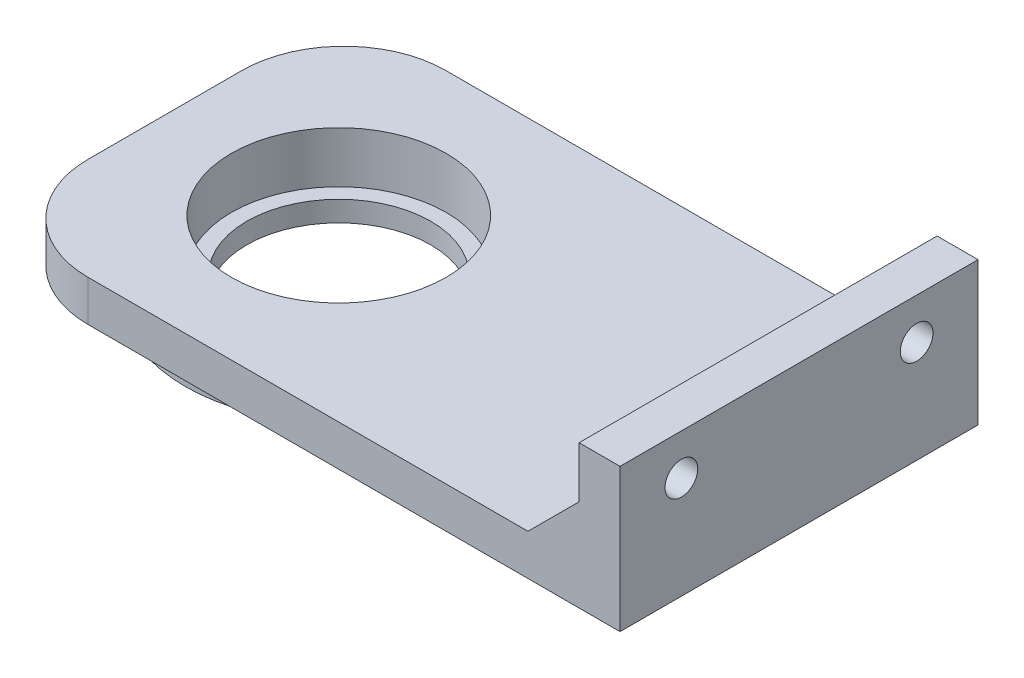
ISO-10303-21;
HEADER;
FILE_DESCRIPTION(('STEP AP214'),'2;1');
FILE_NAME('part.step','',(''),(''),'','','');
FILE_SCHEMA(('AUTOMOTIVE_DESIGN { 1 0 10303 214 1 1 1 1 }'));
ENDSEC;
DATA;
#1=APPLICATION_CONTEXT('core data for automotive mechanical design processes');
#2=APPLICATION_PROTOCOL_DEFINITION('international standard','automotive_design',2000,#1);
#3=PRODUCT_CONTEXT('',#1,'mechanical');
#4=PRODUCT('Part','Part','',(#3));
#5=PRODUCT_RELATED_PRODUCT_CATEGORY('part','',(#4));
#6=PRODUCT_DEFINITION_FORMATION('','',#4);
#7=PRODUCT_DEFINITION_CONTEXT('part definition',#1,'design');
#8=PRODUCT_DEFINITION('design','',#6,#7);
#9=PRODUCT_DEFINITION_SHAPE('','',#8);
#10=(LENGTH_UNIT() NAMED_UNIT(*) SI_UNIT(.MILLI.,.METRE.));
#11=(NAMED_UNIT(*) PLANE_ANGLE_UNIT() SI_UNIT($,.RADIAN.));
#12=(NAMED_UNIT(*) SI_UNIT($,.STERADIAN.) SOLID_ANGLE_UNIT());
#13=UNCERTAINTY_MEASURE_WITH_UNIT(LENGTH_MEASURE(1.E-05),#10,'distance_accuracy_value','');
#14=(GEOMETRIC_REPRESENTATION_CONTEXT(3) GLOBAL_UNCERTAINTY_ASSIGNED_CONTEXT((#13)) GLOBAL_UNIT_ASSIGNED_CONTEXT((#10,
#11,#12)) REPRESENTATION_CONTEXT('',''));
#15=CARTESIAN_POINT('',(0.,0.,0.));
#16=DIRECTION('',(0.,0.,1.));
#17=DIRECTION('',(1.,0.,0.));
#18=AXIS2_PLACEMENT_3D('',#15,#16,#17);
#19=CARTESIAN_POINT('',(27.,9.00000000000004,-17.5));
#20=DIRECTION('',(0.707106781186552,-0.707106781186544,0.));
#21=DIRECTION('',(0.,0.,1.));
#22=AXIS2_PLACEMENT_3D('',#19,#20,#21);
#23=PLANE('',#22);
#24=CARTESIAN_POINT('',(28.,10.,-11.5));
#25=DIRECTION('',(0.707106781186552,-0.707106781186544,0.));
#26=DIRECTION('',(0.707106781186544,0.707106781186551,0.));
#27=AXIS2_PLACEMENT_3D('',#24,#25,#26);
#28=ELLIPSE('',#27,4.24264068711926,3.);
#29=CARTESIAN_POINT('',(27.,9.00000000000004,-14.3284271247462));
#30=VERTEX_POINT('',#29);
#31=CARTESIAN_POINT('',(27.,9.00000000000004,-8.6715728752538));
#32=VERTEX_POINT('',#31);
#33=EDGE_CURVE('E13',#30,#32,#28,.F.);
#34=ORIENTED_EDGE('',*,*,#33,.F.);
#35=DIRECTION('',(0.,0.,1.));
#36=VECTOR('',#35,1.);
#37=CARTESIAN_POINT('',(27.,9.00000000000004,-17.5));
#38=LINE('',#37,#36);
#39=CARTESIAN_POINT('',(27.,9.00000000000004,-17.5));
#40=VERTEX_POINT('',#39);
#41=EDGE_CURVE('E157',#40,#30,#38,.T.);
#42=ORIENTED_EDGE('',*,*,#41,.F.);
#43=DIRECTION('',(0.707106781186544,0.707106781186551,0.));
#44=VECTOR('',#43,1.);
#45=CARTESIAN_POINT('',(26.5,8.49999999999999,-17.5));
#46=LINE('',#45,#44);
#47=CARTESIAN_POINT('',(22.,4.,-17.5));
#48=VERTEX_POINT('',#47);
#49=EDGE_CURVE('E151',#48,#40,#46,.T.);
#50=ORIENTED_EDGE('',*,*,#49,.F.);
#51=DIRECTION('',(0.,0.,-1.));
#52=VECTOR('',#51,1.);
#53=CARTESIAN_POINT('',(22.,4.,0.));
#54=LINE('',#53,#52);
#55=CARTESIAN_POINT('',(22.,4.,17.5));
#56=VERTEX_POINT('',#55);
#57=EDGE_CURVE('E69',#56,#48,#54,.T.);
#58=ORIENTED_EDGE('',*,*,#57,.F.);
#59=DIRECTION('',(-0.707106781186544,-0.707106781186551,0.));
#60=VECTOR('',#59,1.);
#61=CARTESIAN_POINT('',(26.5,8.49999999999999,17.5));
#62=LINE('',#61,#60);
#63=CARTESIAN_POINT('',(27.,9.00000000000004,17.5));
#64=VERTEX_POINT('',#63);
#65=EDGE_CURVE('E170',#64,#56,#62,.T.);
#66=ORIENTED_EDGE('',*,*,#65,.F.);
#67=CARTESIAN_POINT('',(27.,9.00000000000004,14.3284271247462));
#68=VERTEX_POINT('',#67);
#69=EDGE_CURVE('E149',#68,#64,#38,.T.);
#70=ORIENTED_EDGE('',*,*,#69,.F.);
#71=CARTESIAN_POINT('',(28.,10.,11.5));
#72=DIRECTION('',(0.707106781186552,-0.707106781186544,0.));
#73=DIRECTION('',(0.707106781186544,0.707106781186551,0.));
#74=AXIS2_PLACEMENT_3D('',#71,#72,#73);
#75=ELLIPSE('',#74,4.24264068711926,3.);
#76=CARTESIAN_POINT('',(27.,9.00000000000004,8.67157287525378));
#77=VERTEX_POINT('',#76);
#78=EDGE_CURVE('E62',#77,#68,#75,.F.);
#79=ORIENTED_EDGE('',*,*,#78,.F.);
#80=EDGE_CURVE('E147',#32,#77,#38,.T.);
#81=ORIENTED_EDGE('',*,*,#80,.F.);
#82=EDGE_LOOP('',(#34,#42,#50,#58,#66,#70,#79,#81));
#83=FACE_BOUND('',#82,.T.);
#84=ADVANCED_FACE('F54',(#83),#23,.F.);
#85=CARTESIAN_POINT('',(6.,10.,-11.5));
#86=DIRECTION('',(1.,0.,0.));
#87=DIRECTION('',(0.,0.,-1.));
#88=AXIS2_PLACEMENT_3D('',#85,#86,#87);
#89=CYLINDRICAL_SURFACE('',#88,1.6);
#90=CARTESIAN_POINT('',(31.,10.,-11.5));
#91=DIRECTION('',(1.,0.,0.));
#92=DIRECTION('',(0.,0.,-1.));
#93=AXIS2_PLACEMENT_3D('',#90,#91,#92);
#94=CIRCLE('',#93,1.6);
#95=CARTESIAN_POINT('',(31.,10.,-13.1));
#96=VERTEX_POINT('',#95);
#97=EDGE_CURVE('E198',#96,#96,#94,.T.);
#98=ORIENTED_EDGE('',*,*,#97,.T.);
#99=EDGE_LOOP('',(#98));
#100=FACE_BOUND('',#99,.T.);
#101=CARTESIAN_POINT('',(27.,10.,-11.5));
#102=DIRECTION('',(1.,0.,0.));
#103=DIRECTION('',(0.,0.,-1.));
#104=AXIS2_PLACEMENT_3D('',#101,#102,#103);
#105=CIRCLE('',#104,1.6);
#106=CARTESIAN_POINT('',(27.,10.,-13.1));
#107=VERTEX_POINT('',#106);
#108=EDGE_CURVE('E212',#107,#107,#105,.T.);
#109=ORIENTED_EDGE('',*,*,#108,.F.);
#110=EDGE_LOOP('',(#109));
#111=FACE_BOUND('',#110,.T.);
#112=ADVANCED_FACE('F334',(#100,#111),#89,.F.);
#113=CARTESIAN_POINT('',(0.,4.,0.));
#114=DIRECTION('',(0.,1.,0.));
#115=DIRECTION('',(0.,0.,1.));
#116=AXIS2_PLACEMENT_3D('',#113,#114,#115);
#117=PLANE('',#116);
#118=DIRECTION('',(-1.,0.,0.));
#119=VECTOR('',#118,1.);
#120=CARTESIAN_POINT('',(31.,4.,-17.5));
#121=LINE('',#120,#119);
#122=CARTESIAN_POINT('',(-21.,4.,-17.5));
#123=VERTEX_POINT('',#122);
#124=EDGE_CURVE('E187',#48,#123,#121,.T.);
#125=ORIENTED_EDGE('',*,*,#124,.T.);
#126=CARTESIAN_POINT('',(-21.,4.,-7.49999999999999));
#127=DIRECTION('',(0.,1.,0.));
#128=DIRECTION('',(0.,0.,1.));
#129=AXIS2_PLACEMENT_3D('',#126,#127,#128);
#130=CIRCLE('',#129,10.);
#131=CARTESIAN_POINT('',(-31.,4.,-7.49999999999999));
#132=VERTEX_POINT('',#131);
#133=EDGE_CURVE('E287',#123,#132,#130,.T.);
#134=ORIENTED_EDGE('',*,*,#133,.T.);
#135=DIRECTION('',(0.,0.,1.));
#136=VECTOR('',#135,1.);
#137=CARTESIAN_POINT('',(-31.,4.,17.5));
#138=LINE('',#137,#136);
#139=CARTESIAN_POINT('',(-31.,4.,7.50000000000001));
#140=VERTEX_POINT('',#139);
#141=EDGE_CURVE('E239',#132,#140,#138,.T.);
#142=ORIENTED_EDGE('',*,*,#141,.T.);
#143=CARTESIAN_POINT('',(-21.,4.,7.50000000000001));
#144=DIRECTION('',(0.,1.,0.));
#145=DIRECTION('',(0.,0.,1.));
#146=AXIS2_PLACEMENT_3D('',#143,#144,#145);
#147=CIRCLE('',#146,10.);
#148=CARTESIAN_POINT('',(-21.,4.,17.5));
#149=VERTEX_POINT('',#148);
#150=EDGE_CURVE('E289',#140,#149,#147,.T.);
#151=ORIENTED_EDGE('',*,*,#150,.T.);
#152=DIRECTION('',(1.,0.,0.));
#153=VECTOR('',#152,1.);
#154=CARTESIAN_POINT('',(31.,4.,17.5));
#155=LINE('',#154,#153);
#156=EDGE_CURVE('E74',#149,#56,#155,.T.);
#157=ORIENTED_EDGE('',*,*,#156,.T.);
#158=ORIENTED_EDGE('',*,*,#57,.T.);
#159=EDGE_LOOP('',(#125,#134,#142,#151,#157,#158));
#160=FACE_BOUND('',#159,.T.);
#161=CARTESIAN_POINT('',(-14.,4.,0.));
#162=DIRECTION('',(0.,-1.,0.));
#163=DIRECTION('',(0.,0.,-1.));
#164=AXIS2_PLACEMENT_3D('',#161,#162,#163);
#165=CIRCLE('',#164,10.5);
#166=CARTESIAN_POINT('',(-14.,4.,-10.5));
#167=VERTEX_POINT('',#166);
#168=EDGE_CURVE('E142',#167,#167,#165,.T.);
#169=ORIENTED_EDGE('',*,*,#168,.T.);
#170=EDGE_LOOP('',(#169));
#171=FACE_BOUND('',#170,.T.);
#172=ADVANCED_FACE('F301',(#160,#171),#117,.T.);
#173=CARTESIAN_POINT('',(0.,0.,0.));
#174=DIRECTION('',(0.,1.,0.));
#175=DIRECTION('',(0.,0.,1.));
#176=AXIS2_PLACEMENT_3D('',#173,#174,#175);
#177=PLANE('',#176);
#178=CARTESIAN_POINT('',(-14.,0.,0.));
#179=DIRECTION('',(0.,1.,0.));
#180=DIRECTION('',(0.,0.,1.));
#181=AXIS2_PLACEMENT_3D('',#178,#179,#180);
#182=CIRCLE('',#181,15.);
#183=CARTESIAN_POINT('',(-14.,0.,15.));
#184=VERTEX_POINT('',#183);
#185=EDGE_CURVE('E238',#184,#184,#182,.T.);
#186=ORIENTED_EDGE('',*,*,#185,.T.);
#187=EDGE_LOOP('',(#186));
#188=FACE_BOUND('',#187,.T.);
#189=DIRECTION('',(1.,0.,0.));
#190=VECTOR('',#189,1.);
#191=CARTESIAN_POINT('',(31.,0.,17.5));
#192=LINE('',#191,#190);
#193=CARTESIAN_POINT('',(-21.,0.,17.5));
#194=VERTEX_POINT('',#193);
#195=CARTESIAN_POINT('',(31.,0.,17.5));
#196=VERTEX_POINT('',#195);
#197=EDGE_CURVE('E252',#194,#196,#192,.T.);
#198=ORIENTED_EDGE('',*,*,#197,.F.);
#199=CARTESIAN_POINT('',(-21.,0.,7.50000000000001));
#200=DIRECTION('',(0.,1.,0.));
#201=DIRECTION('',(0.,0.,1.));
#202=AXIS2_PLACEMENT_3D('',#199,#200,#201);
#203=CIRCLE('',#202,10.);
#204=CARTESIAN_POINT('',(-31.,0.,7.50000000000001));
#205=VERTEX_POINT('',#204);
#206=EDGE_CURVE('E277',#194,#205,#203,.F.);
#207=ORIENTED_EDGE('',*,*,#206,.T.);
#208=DIRECTION('',(0.,0.,1.));
#209=VECTOR('',#208,1.);
#210=CARTESIAN_POINT('',(-31.,0.,17.5));
#211=LINE('',#210,#209);
#212=CARTESIAN_POINT('',(-31.,0.,-7.49999999999999));
#213=VERTEX_POINT('',#212);
#214=EDGE_CURVE('E248',#213,#205,#211,.T.);
#215=ORIENTED_EDGE('',*,*,#214,.F.);
#216=CARTESIAN_POINT('',(-21.,0.,-7.49999999999999));
#217=DIRECTION('',(0.,1.,0.));
#218=DIRECTION('',(0.,0.,1.));
#219=AXIS2_PLACEMENT_3D('',#216,#217,#218);
#220=CIRCLE('',#219,10.);
#221=CARTESIAN_POINT('',(-21.,0.,-17.5));
#222=VERTEX_POINT('',#221);
#223=EDGE_CURVE('E274',#213,#222,#220,.F.);
#224=ORIENTED_EDGE('',*,*,#223,.T.);
#225=DIRECTION('',(-1.,0.,0.));
#226=VECTOR('',#225,1.);
#227=CARTESIAN_POINT('',(31.,0.,-17.5));
#228=LINE('',#227,#226);
#229=CARTESIAN_POINT('',(31.,0.,-17.5));
#230=VERTEX_POINT('',#229);
#231=EDGE_CURVE('E242',#230,#222,#228,.T.);
#232=ORIENTED_EDGE('',*,*,#231,.F.);
#233=DIRECTION('',(0.,0.,-1.));
#234=VECTOR('',#233,1.);
#235=CARTESIAN_POINT('',(31.,0.,17.5));
#236=LINE('',#235,#234);
#237=EDGE_CURVE('E255',#196,#230,#236,.T.);
#238=ORIENTED_EDGE('',*,*,#237,.F.);
#239=EDGE_LOOP('',(#198,#207,#215,#224,#232,#238));
#240=FACE_BOUND('',#239,.T.);
#241=ADVANCED_FACE('F315',(#188,#240),#177,.F.);
#242=CARTESIAN_POINT('',(-31.,4.,17.5));
#243=DIRECTION('',(1.,0.,0.));
#244=DIRECTION('',(0.,0.,-1.));
#245=AXIS2_PLACEMENT_3D('',#242,#243,#244);
#246=PLANE('',#245);
#247=ORIENTED_EDGE('',*,*,#214,.T.);
#248=DIRECTION('',(0.,-1.,0.));
#249=VECTOR('',#248,1.);
#250=CARTESIAN_POINT('',(-31.,4.,7.50000000000001));
#251=LINE('',#250,#249);
#252=EDGE_CURVE('E284',#205,#140,#251,.F.);
#253=ORIENTED_EDGE('',*,*,#252,.T.);
#254=ORIENTED_EDGE('',*,*,#141,.F.);
#255=DIRECTION('',(0.,-1.,0.));
#256=VECTOR('',#255,1.);
#257=CARTESIAN_POINT('',(-31.,4.,-7.49999999999999));
#258=LINE('',#257,#256);
#259=EDGE_CURVE('E280',#132,#213,#258,.T.);
#260=ORIENTED_EDGE('',*,*,#259,.T.);
#261=EDGE_LOOP('',(#247,#253,#254,#260));
#262=FACE_BOUND('',#261,.T.);
#263=ADVANCED_FACE('F304',(#262),#246,.F.);
#264=CARTESIAN_POINT('',(31.,4.,17.5));
#265=DIRECTION('',(0.,0.,-1.));
#266=DIRECTION('',(-1.,0.,0.));
#267=AXIS2_PLACEMENT_3D('',#264,#265,#266);
#268=PLANE('',#267);
#269=ORIENTED_EDGE('',*,*,#156,.F.);
#270=DIRECTION('',(0.,-1.,0.));
#271=VECTOR('',#270,1.);
#272=CARTESIAN_POINT('',(-21.,4.,17.5));
#273=LINE('',#272,#271);
#274=EDGE_CURVE('E267',#149,#194,#273,.T.);
#275=ORIENTED_EDGE('',*,*,#274,.T.);
#276=ORIENTED_EDGE('',*,*,#197,.T.);
#277=DIRECTION('',(0.,-1.,0.));
#278=VECTOR('',#277,1.);
#279=CARTESIAN_POINT('',(31.,4.,17.5));
#280=LINE('',#279,#278);
#281=CARTESIAN_POINT('',(31.,14.,17.5));
#282=VERTEX_POINT('',#281);
#283=EDGE_CURVE('E263',#282,#196,#280,.T.);
#284=ORIENTED_EDGE('',*,*,#283,.F.);
#285=DIRECTION('',(1.,0.,0.));
#286=VECTOR('',#285,1.);
#287=CARTESIAN_POINT('',(31.,14.,17.5));
#288=LINE('',#287,#286);
#289=CARTESIAN_POINT('',(27.,14.,17.5));
#290=VERTEX_POINT('',#289);
#291=EDGE_CURVE('E228',#290,#282,#288,.T.);
#292=ORIENTED_EDGE('',*,*,#291,.F.);
#293=DIRECTION('',(0.,-1.,0.));
#294=VECTOR('',#293,1.);
#295=CARTESIAN_POINT('',(27.,14.,17.5));
#296=LINE('',#295,#294);
#297=EDGE_CURVE('E193',#290,#64,#296,.T.);
#298=ORIENTED_EDGE('',*,*,#297,.T.);
#299=ORIENTED_EDGE('',*,*,#65,.T.);
#300=EDGE_LOOP('',(#269,#275,#276,#284,#292,#298,#299));
#301=FACE_BOUND('',#300,.T.);
#302=ADVANCED_FACE('F312',(#301),#268,.F.);
#303=CARTESIAN_POINT('',(31.,4.,17.5));
#304=DIRECTION('',(-1.,0.,0.));
#305=DIRECTION('',(0.,0.,1.));
#306=AXIS2_PLACEMENT_3D('',#303,#304,#305);
#307=PLANE('',#306);
#308=CARTESIAN_POINT('',(31.,10.,11.5));
#309=DIRECTION('',(1.,0.,0.));
#310=DIRECTION('',(0.,0.,-1.));
#311=AXIS2_PLACEMENT_3D('',#308,#309,#310);
#312=CIRCLE('',#311,1.6);
#313=CARTESIAN_POINT('',(31.,10.,9.9));
#314=VERTEX_POINT('',#313);
#315=EDGE_CURVE('E205',#314,#314,#312,.T.);
#316=ORIENTED_EDGE('',*,*,#315,.F.);
#317=EDGE_LOOP('',(#316));
#318=FACE_BOUND('',#317,.T.);
#319=ORIENTED_EDGE('',*,*,#97,.F.);
#320=EDGE_LOOP('',(#319));
#321=FACE_BOUND('',#320,.T.);
#322=ORIENTED_EDGE('',*,*,#237,.T.);
#323=DIRECTION('',(0.,-1.,0.));
#324=VECTOR('',#323,1.);
#325=CARTESIAN_POINT('',(31.,4.,-17.5));
#326=LINE('',#325,#324);
#327=CARTESIAN_POINT('',(31.,14.,-17.5));
#328=VERTEX_POINT('',#327);
#329=EDGE_CURVE('E247',#328,#230,#326,.T.);
#330=ORIENTED_EDGE('',*,*,#329,.F.);
#331=DIRECTION('',(0.,0.,-1.));
#332=VECTOR('',#331,1.);
#333=CARTESIAN_POINT('',(31.,14.,-17.5));
#334=LINE('',#333,#332);
#335=EDGE_CURVE('E220',#282,#328,#334,.T.);
#336=ORIENTED_EDGE('',*,*,#335,.F.);
#337=ORIENTED_EDGE('',*,*,#283,.T.);
#338=EDGE_LOOP('',(#322,#330,#336,#337));
#339=FACE_BOUND('',#338,.T.);
#340=ADVANCED_FACE('F317',(#318,#321,#339),#307,.F.);
#341=CARTESIAN_POINT('',(31.,4.,-17.5));
#342=DIRECTION('',(0.,0.,1.));
#343=DIRECTION('',(1.,0.,0.));
#344=AXIS2_PLACEMENT_3D('',#341,#342,#343);
#345=PLANE('',#344);
#346=ORIENTED_EDGE('',*,*,#231,.T.);
#347=DIRECTION('',(0.,-1.,0.));
#348=VECTOR('',#347,1.);
#349=CARTESIAN_POINT('',(-21.,4.,-17.5));
#350=LINE('',#349,#348);
#351=EDGE_CURVE('E164',#222,#123,#350,.F.);
#352=ORIENTED_EDGE('',*,*,#351,.T.);
#353=ORIENTED_EDGE('',*,*,#124,.F.);
#354=ORIENTED_EDGE('',*,*,#49,.T.);
#355=DIRECTION('',(0.,-1.,0.));
#356=VECTOR('',#355,1.);
#357=CARTESIAN_POINT('',(27.,14.,-17.5));
#358=LINE('',#357,#356);
#359=CARTESIAN_POINT('',(27.,14.,-17.5));
#360=VERTEX_POINT('',#359);
#361=EDGE_CURVE('E184',#360,#40,#358,.T.);
#362=ORIENTED_EDGE('',*,*,#361,.F.);
#363=DIRECTION('',(-1.,0.,0.));
#364=VECTOR('',#363,1.);
#365=CARTESIAN_POINT('',(31.,14.,-17.5));
#366=LINE('',#365,#364);
#367=EDGE_CURVE('E224',#328,#360,#366,.T.);
#368=ORIENTED_EDGE('',*,*,#367,.F.);
#369=ORIENTED_EDGE('',*,*,#329,.T.);
#370=EDGE_LOOP('',(#346,#352,#353,#354,#362,#368,#369));
#371=FACE_BOUND('',#370,.T.);
#372=ADVANCED_FACE('F182',(#371),#345,.F.);
#373=CARTESIAN_POINT('',(-14.,-1.,0.));
#374=DIRECTION('',(0.,1.,0.));
#375=DIRECTION('',(0.,0.,1.));
#376=AXIS2_PLACEMENT_3D('',#373,#374,#375);
#377=CYLINDRICAL_SURFACE('',#376,15.);
#378=ORIENTED_EDGE('',*,*,#185,.F.);
#379=EDGE_LOOP('',(#378));
#380=FACE_BOUND('',#379,.T.);
#381=CARTESIAN_POINT('',(-14.,-3.,0.));
#382=DIRECTION('',(0.,-1.,0.));
#383=DIRECTION('',(0.,0.,-1.));
#384=AXIS2_PLACEMENT_3D('',#381,#382,#383);
#385=CIRCLE('',#384,15.);
#386=CARTESIAN_POINT('',(-14.,-3.,-15.));
#387=VERTEX_POINT('',#386);
#388=EDGE_CURVE('E373',#387,#387,#385,.T.);
#389=ORIENTED_EDGE('',*,*,#388,.F.);
#390=EDGE_LOOP('',(#389));
#391=FACE_BOUND('',#390,.T.);
#392=ADVANCED_FACE('F385',(#380,#391),#377,.T.);
#393=CARTESIAN_POINT('',(-14.,4.,0.));
#394=DIRECTION('',(0.,-1.,0.));
#395=DIRECTION('',(0.,0.,-1.));
#396=AXIS2_PLACEMENT_3D('',#393,#394,#395);
#397=CYLINDRICAL_SURFACE('',#396,10.5);
#398=ORIENTED_EDGE('',*,*,#168,.F.);
#399=EDGE_LOOP('',(#398));
#400=FACE_BOUND('',#399,.T.);
#401=CARTESIAN_POINT('',(-14.,-1.,0.));
#402=DIRECTION('',(0.,1.,0.));
#403=DIRECTION('',(0.,0.,1.));
#404=AXIS2_PLACEMENT_3D('',#401,#402,#403);
#405=CIRCLE('',#404,10.5);
#406=CARTESIAN_POINT('',(-14.,-1.,10.5));
#407=VERTEX_POINT('',#406);
#408=EDGE_CURVE('E192',#407,#407,#405,.T.);
#409=ORIENTED_EDGE('',*,*,#408,.F.);
#410=EDGE_LOOP('',(#409));
#411=FACE_BOUND('',#410,.T.);
#412=ADVANCED_FACE('F382',(#400,#411),#397,.F.);
#413=CARTESIAN_POINT('',(-21.,4.,7.50000000000001));
#414=DIRECTION('',(0.,-1.,0.));
#415=DIRECTION('',(0.,0.,-1.));
#416=AXIS2_PLACEMENT_3D('',#413,#414,#415);
#417=CYLINDRICAL_SURFACE('',#416,10.);
#418=ORIENTED_EDGE('',*,*,#150,.F.);
#419=ORIENTED_EDGE('',*,*,#252,.F.);
#420=ORIENTED_EDGE('',*,*,#206,.F.);
#421=ORIENTED_EDGE('',*,*,#274,.F.);
#422=EDGE_LOOP('',(#418,#419,#420,#421));
#423=FACE_BOUND('',#422,.T.);
#424=ADVANCED_FACE('F308',(#423),#417,.T.);
#425=CARTESIAN_POINT('',(-21.,4.,-7.49999999999999));
#426=DIRECTION('',(0.,-1.,0.));
#427=DIRECTION('',(0.,0.,-1.));
#428=AXIS2_PLACEMENT_3D('',#425,#426,#427);
#429=CYLINDRICAL_SURFACE('',#428,10.);
#430=ORIENTED_EDGE('',*,*,#133,.F.);
#431=ORIENTED_EDGE('',*,*,#351,.F.);
#432=ORIENTED_EDGE('',*,*,#223,.F.);
#433=ORIENTED_EDGE('',*,*,#259,.F.);
#434=EDGE_LOOP('',(#430,#431,#432,#433));
#435=FACE_BOUND('',#434,.T.);
#436=ADVANCED_FACE('F299',(#435),#429,.T.);
#437=CARTESIAN_POINT('',(27.,14.,-17.5));
#438=DIRECTION('',(1.,0.,0.));
#439=DIRECTION('',(0.,0.,-1.));
#440=AXIS2_PLACEMENT_3D('',#437,#438,#439);
#441=PLANE('',#440);
#442=ORIENTED_EDGE('',*,*,#41,.T.);
#443=CARTESIAN_POINT('',(27.,10.,-11.5));
#444=DIRECTION('',(-1.,0.,0.));
#445=DIRECTION('',(0.,0.,1.));
#446=AXIS2_PLACEMENT_3D('',#443,#444,#445);
#447=CIRCLE('',#446,3.);
#448=EDGE_CURVE('E141',#30,#32,#447,.T.);
#449=ORIENTED_EDGE('',*,*,#448,.T.);
#450=ORIENTED_EDGE('',*,*,#80,.T.);
#451=CARTESIAN_POINT('',(27.,10.,11.5));
#452=DIRECTION('',(-1.,0.,0.));
#453=DIRECTION('',(0.,0.,-1.));
#454=AXIS2_PLACEMENT_3D('',#451,#452,#453);
#455=CIRCLE('',#454,3.);
#456=EDGE_CURVE('E134',#77,#68,#455,.T.);
#457=ORIENTED_EDGE('',*,*,#456,.T.);
#458=ORIENTED_EDGE('',*,*,#69,.T.);
#459=ORIENTED_EDGE('',*,*,#297,.F.);
#460=DIRECTION('',(0.,0.,1.));
#461=VECTOR('',#460,1.);
#462=CARTESIAN_POINT('',(27.,14.,-17.5));
#463=LINE('',#462,#461);
#464=EDGE_CURVE('E190',#360,#290,#463,.T.);
#465=ORIENTED_EDGE('',*,*,#464,.F.);
#466=ORIENTED_EDGE('',*,*,#361,.T.);
#467=EDGE_LOOP('',(#442,#449,#450,#457,#458,#459,#465,#466));
#468=FACE_BOUND('',#467,.T.);
#469=CARTESIAN_POINT('',(27.,10.,11.5));
#470=DIRECTION('',(1.,0.,0.));
#471=DIRECTION('',(0.,0.,-1.));
#472=AXIS2_PLACEMENT_3D('',#469,#470,#471);
#473=CIRCLE('',#472,1.6);
#474=CARTESIAN_POINT('',(27.,10.,9.9));
#475=VERTEX_POINT('',#474);
#476=EDGE_CURVE('E217',#475,#475,#473,.T.);
#477=ORIENTED_EDGE('',*,*,#476,.T.);
#478=EDGE_LOOP('',(#477));
#479=FACE_BOUND('',#478,.T.);
#480=ORIENTED_EDGE('',*,*,#108,.T.);
#481=EDGE_LOOP('',(#480));
#482=FACE_BOUND('',#481,.T.);
#483=ADVANCED_FACE('F154',(#468,#479,#482),#441,.F.);
#484=CARTESIAN_POINT('',(0.,14.,0.));
#485=DIRECTION('',(0.,-1.,0.));
#486=DIRECTION('',(0.,0.,-1.));
#487=AXIS2_PLACEMENT_3D('',#484,#485,#486);
#488=PLANE('',#487);
#489=ORIENTED_EDGE('',*,*,#335,.T.);
#490=ORIENTED_EDGE('',*,*,#367,.T.);
#491=ORIENTED_EDGE('',*,*,#464,.T.);
#492=ORIENTED_EDGE('',*,*,#291,.T.);
#493=EDGE_LOOP('',(#489,#490,#491,#492));
#494=FACE_BOUND('',#493,.T.);
#495=ADVANCED_FACE('F320',(#494),#488,.F.);
#496=CARTESIAN_POINT('',(6.,10.,11.5));
#497=DIRECTION('',(1.,0.,0.));
#498=DIRECTION('',(0.,0.,-1.));
#499=AXIS2_PLACEMENT_3D('',#496,#497,#498);
#500=CYLINDRICAL_SURFACE('',#499,1.6);
#501=ORIENTED_EDGE('',*,*,#315,.T.);
#502=EDGE_LOOP('',(#501));
#503=FACE_BOUND('',#502,.T.);
#504=ORIENTED_EDGE('',*,*,#476,.F.);
#505=EDGE_LOOP('',(#504));
#506=FACE_BOUND('',#505,.T.);
#507=ADVANCED_FACE('F323',(#503,#506),#500,.F.);
#508=CARTESIAN_POINT('',(2.00000000000001,10.,11.5));
#509=DIRECTION('',(1.,0.,0.));
#510=DIRECTION('',(0.,0.,-1.));
#511=AXIS2_PLACEMENT_3D('',#508,#509,#510);
#512=CYLINDRICAL_SURFACE('',#511,3.);
#513=ORIENTED_EDGE('',*,*,#78,.T.);
#514=ORIENTED_EDGE('',*,*,#456,.F.);
#515=EDGE_LOOP('',(#513,#514));
#516=FACE_BOUND('',#515,.T.);
#517=ADVANCED_FACE('F136',(#516),#512,.F.);
#518=CARTESIAN_POINT('',(2.,10.,-11.5));
#519=DIRECTION('',(1.,0.,0.));
#520=DIRECTION('',(0.,0.,-1.));
#521=AXIS2_PLACEMENT_3D('',#518,#519,#520);
#522=CYLINDRICAL_SURFACE('',#521,3.);
#523=ORIENTED_EDGE('',*,*,#33,.T.);
#524=ORIENTED_EDGE('',*,*,#448,.F.);
#525=EDGE_LOOP('',(#523,#524));
#526=FACE_BOUND('',#525,.T.);
#527=ADVANCED_FACE('F196',(#526),#522,.F.);
#528=CARTESIAN_POINT('',(-14.,-1.,0.));
#529=DIRECTION('',(0.,-1.,0.));
#530=DIRECTION('',(0.,0.,-1.));
#531=AXIS2_PLACEMENT_3D('',#528,#529,#530);
#532=PLANE('',#531);
#533=CARTESIAN_POINT('',(-14.,-1.,0.));
#534=DIRECTION('',(0.,-1.,0.));
#535=DIRECTION('',(0.,0.,-1.));
#536=AXIS2_PLACEMENT_3D('',#533,#534,#535);
#537=CIRCLE('',#536,9.);
#538=CARTESIAN_POINT('',(-14.,-1.,-9.));
#539=VERTEX_POINT('',#538);
#540=EDGE_CURVE('E368',#539,#539,#537,.T.);
#541=ORIENTED_EDGE('',*,*,#540,.T.);
#542=EDGE_LOOP('',(#541));
#543=FACE_BOUND('',#542,.T.);
#544=ORIENTED_EDGE('',*,*,#408,.T.);
#545=EDGE_LOOP('',(#544));
#546=FACE_BOUND('',#545,.T.);
#547=ADVANCED_FACE('F349',(#543,#546),#532,.F.);
#548=CARTESIAN_POINT('',(-14.,-3.,0.));
#549=DIRECTION('',(0.,-1.,0.));
#550=DIRECTION('',(0.,0.,-1.));
#551=AXIS2_PLACEMENT_3D('',#548,#549,#550);
#552=PLANE('',#551);
#553=ORIENTED_EDGE('',*,*,#388,.T.);
#554=EDGE_LOOP('',(#553));
#555=FACE_BOUND('',#554,.T.);
#556=CARTESIAN_POINT('',(-14.,-3.,0.));
#557=DIRECTION('',(0.,-1.,0.));
#558=DIRECTION('',(0.,0.,-1.));
#559=AXIS2_PLACEMENT_3D('',#556,#557,#558);
#560=CIRCLE('',#559,9.);
#561=CARTESIAN_POINT('',(-14.,-3.,-9.));
#562=VERTEX_POINT('',#561);
#563=EDGE_CURVE('E365',#562,#562,#560,.T.);
#564=ORIENTED_EDGE('',*,*,#563,.F.);
#565=EDGE_LOOP('',(#564));
#566=FACE_BOUND('',#565,.T.);
#567=ADVANCED_FACE('F352',(#555,#566),#552,.T.);
#568=CARTESIAN_POINT('',(-14.,-3.,0.));
#569=DIRECTION('',(0.,1.,0.));
#570=DIRECTION('',(0.,0.,1.));
#571=AXIS2_PLACEMENT_3D('',#568,#569,#570);
#572=CYLINDRICAL_SURFACE('',#571,9.);
#573=ORIENTED_EDGE('',*,*,#563,.T.);
#574=EDGE_LOOP('',(#573));
#575=FACE_BOUND('',#574,.T.);
#576=ORIENTED_EDGE('',*,*,#540,.F.);
#577=EDGE_LOOP('',(#576));
#578=FACE_BOUND('',#577,.T.);
#579=ADVANCED_FACE('F356',(#575,#578),#572,.F.);
#580=CLOSED_SHELL('',(#84,#112,#172,#241,#263,#302,#340,#372,#392,#412,#424,#436,#483,#495,#507,
#517,#527,#547,#567,#579));
#581=MANIFOLD_SOLID_BREP('B2',#580);
#582=ADVANCED_BREP_SHAPE_REPRESENTATION('',(#18,#581),#14);
#583=SHAPE_DEFINITION_REPRESENTATION(#9,#582);
ENDSEC;
END-ISO-10303-21;
